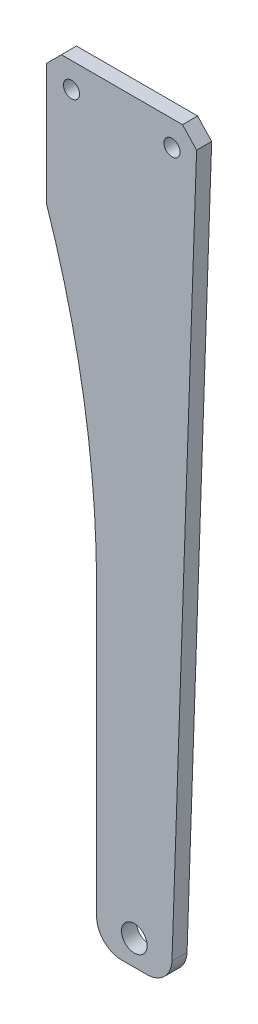
ISO-10303-21;
HEADER;
FILE_DESCRIPTION(('STEP AP214'),'2;1');
FILE_NAME('part.step','',(''),(''),'','','');
FILE_SCHEMA(('AUTOMOTIVE_DESIGN { 1 0 10303 214 1 1 1 1 }'));
ENDSEC;
DATA;
#1=APPLICATION_CONTEXT('core data for automotive mechanical design processes');
#2=APPLICATION_PROTOCOL_DEFINITION('international standard','automotive_design',2000,#1);
#3=PRODUCT_CONTEXT('',#1,'mechanical');
#4=PRODUCT('Part','Part','',(#3));
#5=PRODUCT_RELATED_PRODUCT_CATEGORY('part','',(#4));
#6=PRODUCT_DEFINITION_FORMATION('','',#4);
#7=PRODUCT_DEFINITION_CONTEXT('part definition',#1,'design');
#8=PRODUCT_DEFINITION('design','',#6,#7);
#9=PRODUCT_DEFINITION_SHAPE('','',#8);
#10=(LENGTH_UNIT() NAMED_UNIT(*) SI_UNIT(.MILLI.,.METRE.));
#11=(NAMED_UNIT(*) PLANE_ANGLE_UNIT() SI_UNIT($,.RADIAN.));
#12=(NAMED_UNIT(*) SI_UNIT($,.STERADIAN.) SOLID_ANGLE_UNIT());
#13=UNCERTAINTY_MEASURE_WITH_UNIT(LENGTH_MEASURE(1.E-05),#10,'distance_accuracy_value','');
#14=(GEOMETRIC_REPRESENTATION_CONTEXT(3) GLOBAL_UNCERTAINTY_ASSIGNED_CONTEXT((#13)) GLOBAL_UNIT_ASSIGNED_CONTEXT((#10,
#11,#12)) REPRESENTATION_CONTEXT('',''));
#15=CARTESIAN_POINT('',(0.,0.,0.));
#16=DIRECTION('',(0.,0.,1.));
#17=DIRECTION('',(1.,0.,0.));
#18=AXIS2_PLACEMENT_3D('',#15,#16,#17);
#19=CARTESIAN_POINT('',(0.,0.,3.));
#20=DIRECTION('',(0.,0.,1.));
#21=DIRECTION('',(1.,0.,0.));
#22=AXIS2_PLACEMENT_3D('',#19,#20,#21);
#23=PLANE('',#22);
#24=CARTESIAN_POINT('',(20.,0.,3.));
#25=DIRECTION('',(0.,0.,1.));
#26=DIRECTION('',(1.,0.,0.));
#27=AXIS2_PLACEMENT_3D('',#24,#25,#26);
#28=CIRCLE('',#27,1.6);
#29=CARTESIAN_POINT('',(21.6,0.,3.));
#30=VERTEX_POINT('',#29);
#31=EDGE_CURVE('E239',#30,#30,#28,.T.);
#32=ORIENTED_EDGE('',*,*,#31,.F.);
#33=EDGE_LOOP('',(#32));
#34=FACE_BOUND('',#33,.T.);
#35=CARTESIAN_POINT('',(0.,0.,3.));
#36=DIRECTION('',(0.,0.,1.));
#37=DIRECTION('',(1.,0.,0.));
#38=AXIS2_PLACEMENT_3D('',#35,#36,#37);
#39=CIRCLE('',#38,1.6);
#40=CARTESIAN_POINT('',(1.6,0.,3.));
#41=VERTEX_POINT('',#40);
#42=EDGE_CURVE('E246',#41,#41,#39,.T.);
#43=ORIENTED_EDGE('',*,*,#42,.F.);
#44=EDGE_LOOP('',(#43));
#45=FACE_BOUND('',#44,.T.);
#46=CARTESIAN_POINT('',(12.5,-140.,3.));
#47=DIRECTION('',(0.,0.,1.));
#48=DIRECTION('',(1.,0.,0.));
#49=AXIS2_PLACEMENT_3D('',#46,#47,#48);
#50=CIRCLE('',#49,2.54999999999999);
#51=CARTESIAN_POINT('',(15.05,-140.,3.));
#52=VERTEX_POINT('',#51);
#53=EDGE_CURVE('E219',#52,#52,#50,.T.);
#54=ORIENTED_EDGE('',*,*,#53,.F.);
#55=EDGE_LOOP('',(#54));
#56=FACE_BOUND('',#55,.T.);
#57=DIRECTION('',(-0.0344418416394506,-0.999406703772035,0.));
#58=VECTOR('',#57,1.);
#59=CARTESIAN_POINT('',(24.7982369514885,-0.854603983340457,3.));
#60=LINE('',#59,#58);
#61=CARTESIAN_POINT('',(24.8966744750817,2.00177988868389,3.));
#62=VERTEX_POINT('',#61);
#63=CARTESIAN_POINT('',(19.9970335188602,-140.172209208197,3.));
#64=VERTEX_POINT('',#63);
#65=EDGE_CURVE('E179',#62,#64,#60,.T.);
#66=ORIENTED_EDGE('',*,*,#65,.F.);
#67=DIRECTION('',(0.682333197620691,-0.731041317180311,0.));
#68=VECTOR('',#67,1.);
#69=CARTESIAN_POINT('',(14.3038311652233,13.3507896582896,3.));
#70=LINE('',#69,#68);
#71=CARTESIAN_POINT('',(22.0982209983127,5.,3.));
#72=VERTEX_POINT('',#71);
#73=EDGE_CURVE('E49',#62,#72,#70,.F.);
#74=ORIENTED_EDGE('',*,*,#73,.T.);
#75=DIRECTION('',(-1.,0.,0.));
#76=VECTOR('',#75,1.);
#77=CARTESIAN_POINT('',(-5.,5.,3.));
#78=LINE('',#77,#76);
#79=CARTESIAN_POINT('',(-2.,5.,3.));
#80=VERTEX_POINT('',#79);
#81=EDGE_CURVE('E148',#72,#80,#78,.T.);
#82=ORIENTED_EDGE('',*,*,#81,.T.);
#83=DIRECTION('',(0.707106781186551,0.707106781186544,0.));
#84=VECTOR('',#83,1.);
#85=CARTESIAN_POINT('',(-3.49999999999999,3.50000000000002,3.));
#86=LINE('',#85,#84);
#87=CARTESIAN_POINT('',(-5.,2.00000000000003,3.));
#88=VERTEX_POINT('',#87);
#89=EDGE_CURVE('E56',#80,#88,#86,.F.);
#90=ORIENTED_EDGE('',*,*,#89,.T.);
#91=DIRECTION('',(0.,-1.,0.));
#92=VECTOR('',#91,1.);
#93=CARTESIAN_POINT('',(-5.,5.,3.));
#94=LINE('',#93,#92);
#95=CARTESIAN_POINT('',(-5.,-22.058761090833,3.));
#96=VERTEX_POINT('',#95);
#97=EDGE_CURVE('E152',#88,#96,#94,.T.);
#98=ORIENTED_EDGE('',*,*,#97,.T.);
#99=CARTESIAN_POINT('',(-186.334443723791,-83.1053734004102,3.));
#100=DIRECTION('',(0.,0.,1.));
#101=DIRECTION('',(1.,0.,0.));
#102=AXIS2_PLACEMENT_3D('',#99,#100,#101);
#103=CIRCLE('',#102,191.334443723791);
#104=CARTESIAN_POINT('',(5.,-83.1053734004102,3.));
#105=VERTEX_POINT('',#104);
#106=EDGE_CURVE('E210',#105,#96,#103,.T.);
#107=ORIENTED_EDGE('',*,*,#106,.F.);
#108=DIRECTION('',(0.,1.,0.));
#109=VECTOR('',#108,1.);
#110=CARTESIAN_POINT('',(5.,0.,3.));
#111=LINE('',#110,#109);
#112=CARTESIAN_POINT('',(5.,-140.,3.));
#113=VERTEX_POINT('',#112);
#114=EDGE_CURVE('E199',#113,#105,#111,.T.);
#115=ORIENTED_EDGE('',*,*,#114,.F.);
#116=CARTESIAN_POINT('',(10.,-140.,3.));
#117=DIRECTION('',(0.,0.,1.));
#118=DIRECTION('',(1.,0.,0.));
#119=AXIS2_PLACEMENT_3D('',#116,#117,#118);
#120=CIRCLE('',#119,5.);
#121=CARTESIAN_POINT('',(10.,-145.,3.));
#122=VERTEX_POINT('',#121);
#123=EDGE_CURVE('E203',#113,#122,#120,.T.);
#124=ORIENTED_EDGE('',*,*,#123,.T.);
#125=DIRECTION('',(1.,0.,0.));
#126=VECTOR('',#125,1.);
#127=CARTESIAN_POINT('',(-4.99999999999998,-145.,3.));
#128=LINE('',#127,#126);
#129=CARTESIAN_POINT('',(15.,-145.,3.));
#130=VERTEX_POINT('',#129);
#131=EDGE_CURVE('E163',#122,#130,#128,.T.);
#132=ORIENTED_EDGE('',*,*,#131,.T.);
#133=CARTESIAN_POINT('',(15.,-140.,3.));
#134=DIRECTION('',(0.,0.,1.));
#135=DIRECTION('',(1.,0.,0.));
#136=AXIS2_PLACEMENT_3D('',#133,#134,#135);
#137=CIRCLE('',#136,5.);
#138=EDGE_CURVE('E126',#130,#64,#137,.T.);
#139=ORIENTED_EDGE('',*,*,#138,.T.);
#140=EDGE_LOOP('',(#66,#74,#82,#90,#98,#107,#115,#124,#132,#139));
#141=FACE_BOUND('',#140,.T.);
#142=ADVANCED_FACE('F40',(#34,#45,#56,#141),#23,.T.);
#143=CARTESIAN_POINT('',(0.,0.,0.));
#144=DIRECTION('',(0.,0.,1.));
#145=DIRECTION('',(1.,0.,0.));
#146=AXIS2_PLACEMENT_3D('',#143,#144,#145);
#147=PLANE('',#146);
#148=CARTESIAN_POINT('',(20.,0.,0.));
#149=DIRECTION('',(0.,0.,1.));
#150=DIRECTION('',(1.,0.,0.));
#151=AXIS2_PLACEMENT_3D('',#148,#149,#150);
#152=CIRCLE('',#151,1.6);
#153=CARTESIAN_POINT('',(21.6,0.,0.));
#154=VERTEX_POINT('',#153);
#155=EDGE_CURVE('E238',#154,#154,#152,.T.);
#156=ORIENTED_EDGE('',*,*,#155,.T.);
#157=EDGE_LOOP('',(#156));
#158=FACE_BOUND('',#157,.T.);
#159=CARTESIAN_POINT('',(0.,0.,0.));
#160=DIRECTION('',(0.,0.,1.));
#161=DIRECTION('',(1.,0.,0.));
#162=AXIS2_PLACEMENT_3D('',#159,#160,#161);
#163=CIRCLE('',#162,1.6);
#164=CARTESIAN_POINT('',(1.6,0.,0.));
#165=VERTEX_POINT('',#164);
#166=EDGE_CURVE('E242',#165,#165,#163,.T.);
#167=ORIENTED_EDGE('',*,*,#166,.T.);
#168=EDGE_LOOP('',(#167));
#169=FACE_BOUND('',#168,.T.);
#170=CARTESIAN_POINT('',(12.5,-140.,0.));
#171=DIRECTION('',(0.,0.,1.));
#172=DIRECTION('',(1.,0.,0.));
#173=AXIS2_PLACEMENT_3D('',#170,#171,#172);
#174=CIRCLE('',#173,2.54999999999999);
#175=CARTESIAN_POINT('',(15.05,-140.,0.));
#176=VERTEX_POINT('',#175);
#177=EDGE_CURVE('E234',#176,#176,#174,.F.);
#178=ORIENTED_EDGE('',*,*,#177,.F.);
#179=EDGE_LOOP('',(#178));
#180=FACE_BOUND('',#179,.T.);
#181=DIRECTION('',(-1.,0.,0.));
#182=VECTOR('',#181,1.);
#183=CARTESIAN_POINT('',(-5.,5.,0.));
#184=LINE('',#183,#182);
#185=CARTESIAN_POINT('',(22.0982209983127,5.,0.));
#186=VERTEX_POINT('',#185);
#187=CARTESIAN_POINT('',(-2.,5.,0.));
#188=VERTEX_POINT('',#187);
#189=EDGE_CURVE('E155',#186,#188,#184,.T.);
#190=ORIENTED_EDGE('',*,*,#189,.F.);
#191=DIRECTION('',(-0.682333197620691,0.731041317180311,0.));
#192=VECTOR('',#191,1.);
#193=CARTESIAN_POINT('',(22.0982209983127,5.,0.));
#194=LINE('',#193,#192);
#195=CARTESIAN_POINT('',(24.8966744750817,2.0017798886839,0.));
#196=VERTEX_POINT('',#195);
#197=EDGE_CURVE('E170',#186,#196,#194,.F.);
#198=ORIENTED_EDGE('',*,*,#197,.T.);
#199=DIRECTION('',(-0.0344418416394506,-0.999406703772035,0.));
#200=VECTOR('',#199,1.);
#201=CARTESIAN_POINT('',(24.7982369514885,-0.854603983340457,0.));
#202=LINE('',#201,#200);
#203=CARTESIAN_POINT('',(19.9970335188602,-140.172209208197,0.));
#204=VERTEX_POINT('',#203);
#205=EDGE_CURVE('E140',#196,#204,#202,.T.);
#206=ORIENTED_EDGE('',*,*,#205,.T.);
#207=CARTESIAN_POINT('',(15.,-140.,0.));
#208=DIRECTION('',(0.,0.,1.));
#209=DIRECTION('',(1.,0.,0.));
#210=AXIS2_PLACEMENT_3D('',#207,#208,#209);
#211=CIRCLE('',#210,5.);
#212=CARTESIAN_POINT('',(15.,-145.,0.));
#213=VERTEX_POINT('',#212);
#214=EDGE_CURVE('E124',#213,#204,#211,.T.);
#215=ORIENTED_EDGE('',*,*,#214,.F.);
#216=DIRECTION('',(1.,0.,0.));
#217=VECTOR('',#216,1.);
#218=CARTESIAN_POINT('',(-4.99999999999998,-145.,0.));
#219=LINE('',#218,#217);
#220=CARTESIAN_POINT('',(10.,-145.,0.));
#221=VERTEX_POINT('',#220);
#222=EDGE_CURVE('E138',#221,#213,#219,.T.);
#223=ORIENTED_EDGE('',*,*,#222,.F.);
#224=CARTESIAN_POINT('',(10.,-140.,0.));
#225=DIRECTION('',(0.,0.,1.));
#226=DIRECTION('',(1.,0.,0.));
#227=AXIS2_PLACEMENT_3D('',#224,#225,#226);
#228=CIRCLE('',#227,5.);
#229=CARTESIAN_POINT('',(5.,-140.,0.));
#230=VERTEX_POINT('',#229);
#231=EDGE_CURVE('E143',#230,#221,#228,.T.);
#232=ORIENTED_EDGE('',*,*,#231,.F.);
#233=DIRECTION('',(0.,1.,0.));
#234=VECTOR('',#233,1.);
#235=CARTESIAN_POINT('',(5.,0.,0.));
#236=LINE('',#235,#234);
#237=CARTESIAN_POINT('',(5.,-83.1053734004102,0.));
#238=VERTEX_POINT('',#237);
#239=EDGE_CURVE('E214',#230,#238,#236,.T.);
#240=ORIENTED_EDGE('',*,*,#239,.T.);
#241=CARTESIAN_POINT('',(-186.334443723791,-83.1053734004102,0.));
#242=DIRECTION('',(0.,0.,1.));
#243=DIRECTION('',(1.,0.,0.));
#244=AXIS2_PLACEMENT_3D('',#241,#242,#243);
#245=CIRCLE('',#244,191.334443723791);
#246=CARTESIAN_POINT('',(-5.,-22.058761090833,0.));
#247=VERTEX_POINT('',#246);
#248=EDGE_CURVE('E189',#238,#247,#245,.T.);
#249=ORIENTED_EDGE('',*,*,#248,.T.);
#250=DIRECTION('',(0.,-1.,0.));
#251=VECTOR('',#250,1.);
#252=CARTESIAN_POINT('',(-5.,5.,0.));
#253=LINE('',#252,#251);
#254=CARTESIAN_POINT('',(-5.,2.00000000000003,0.));
#255=VERTEX_POINT('',#254);
#256=EDGE_CURVE('E149',#255,#247,#253,.T.);
#257=ORIENTED_EDGE('',*,*,#256,.F.);
#258=DIRECTION('',(-0.707106781186551,-0.707106781186544,0.));
#259=VECTOR('',#258,1.);
#260=CARTESIAN_POINT('',(-5.,2.00000000000003,0.));
#261=LINE('',#260,#259);
#262=EDGE_CURVE('E167',#255,#188,#261,.F.);
#263=ORIENTED_EDGE('',*,*,#262,.T.);
#264=EDGE_LOOP('',(#190,#198,#206,#215,#223,#232,#240,#249,#257,#263));
#265=FACE_BOUND('',#264,.T.);
#266=ADVANCED_FACE('F137',(#158,#169,#180,#265),#147,.F.);
#267=CARTESIAN_POINT('',(-5.,5.,3.));
#268=DIRECTION('',(1.,0.,0.));
#269=DIRECTION('',(0.,1.,0.));
#270=AXIS2_PLACEMENT_3D('',#267,#268,#269);
#271=PLANE('',#270);
#272=ORIENTED_EDGE('',*,*,#97,.F.);
#273=DIRECTION('',(0.,0.,-1.));
#274=VECTOR('',#273,1.);
#275=CARTESIAN_POINT('',(-5.,2.00000000000003,3.));
#276=LINE('',#275,#274);
#277=EDGE_CURVE('E11',#88,#255,#276,.T.);
#278=ORIENTED_EDGE('',*,*,#277,.T.);
#279=ORIENTED_EDGE('',*,*,#256,.T.);
#280=DIRECTION('',(0.,0.,1.));
#281=VECTOR('',#280,1.);
#282=CARTESIAN_POINT('',(-5.,-22.058761090833,0.));
#283=LINE('',#282,#281);
#284=EDGE_CURVE('E220',#247,#96,#283,.T.);
#285=ORIENTED_EDGE('',*,*,#284,.T.);
#286=EDGE_LOOP('',(#272,#278,#279,#285));
#287=FACE_BOUND('',#286,.T.);
#288=ADVANCED_FACE('F261',(#287),#271,.F.);
#289=CARTESIAN_POINT('',(-4.99999999999998,-145.,3.));
#290=DIRECTION('',(0.,1.,0.));
#291=DIRECTION('',(0.,0.,1.));
#292=AXIS2_PLACEMENT_3D('',#289,#290,#291);
#293=PLANE('',#292);
#294=ORIENTED_EDGE('',*,*,#222,.T.);
#295=DIRECTION('',(0.,0.,1.));
#296=VECTOR('',#295,1.);
#297=CARTESIAN_POINT('',(15.,-145.,0.));
#298=LINE('',#297,#296);
#299=EDGE_CURVE('E120',#213,#130,#298,.T.);
#300=ORIENTED_EDGE('',*,*,#299,.T.);
#301=ORIENTED_EDGE('',*,*,#131,.F.);
#302=DIRECTION('',(0.,0.,1.));
#303=VECTOR('',#302,1.);
#304=CARTESIAN_POINT('',(10.,-145.,0.));
#305=LINE('',#304,#303);
#306=EDGE_CURVE('E132',#221,#122,#305,.T.);
#307=ORIENTED_EDGE('',*,*,#306,.F.);
#308=EDGE_LOOP('',(#294,#300,#301,#307));
#309=FACE_BOUND('',#308,.T.);
#310=ADVANCED_FACE('F145',(#309),#293,.F.);
#311=CARTESIAN_POINT('',(-5.,5.,3.));
#312=DIRECTION('',(0.,-1.,0.));
#313=DIRECTION('',(0.,0.,-1.));
#314=AXIS2_PLACEMENT_3D('',#311,#312,#313);
#315=PLANE('',#314);
#316=ORIENTED_EDGE('',*,*,#81,.F.);
#317=DIRECTION('',(0.,0.,-1.));
#318=VECTOR('',#317,1.);
#319=CARTESIAN_POINT('',(22.0982209983127,5.,3.));
#320=LINE('',#319,#318);
#321=EDGE_CURVE('E162',#72,#186,#320,.T.);
#322=ORIENTED_EDGE('',*,*,#321,.T.);
#323=ORIENTED_EDGE('',*,*,#189,.T.);
#324=DIRECTION('',(0.,0.,1.));
#325=VECTOR('',#324,1.);
#326=CARTESIAN_POINT('',(-2.,5.,3.));
#327=LINE('',#326,#325);
#328=EDGE_CURVE('E159',#188,#80,#327,.T.);
#329=ORIENTED_EDGE('',*,*,#328,.T.);
#330=EDGE_LOOP('',(#316,#322,#323,#329));
#331=FACE_BOUND('',#330,.T.);
#332=ADVANCED_FACE('F183',(#331),#315,.F.);
#333=CARTESIAN_POINT('',(0.,0.,3.));
#334=DIRECTION('',(0.,0.,-1.));
#335=DIRECTION('',(-1.,0.,0.));
#336=AXIS2_PLACEMENT_3D('',#333,#334,#335);
#337=CYLINDRICAL_SURFACE('',#336,1.6);
#338=ORIENTED_EDGE('',*,*,#42,.T.);
#339=EDGE_LOOP('',(#338));
#340=FACE_BOUND('',#339,.T.);
#341=ORIENTED_EDGE('',*,*,#166,.F.);
#342=EDGE_LOOP('',(#341));
#343=FACE_BOUND('',#342,.T.);
#344=ADVANCED_FACE('F301',(#340,#343),#337,.F.);
#345=CARTESIAN_POINT('',(20.,0.,3.));
#346=DIRECTION('',(0.,0.,-1.));
#347=DIRECTION('',(-1.,0.,0.));
#348=AXIS2_PLACEMENT_3D('',#345,#346,#347);
#349=CYLINDRICAL_SURFACE('',#348,1.6);
#350=ORIENTED_EDGE('',*,*,#31,.T.);
#351=EDGE_LOOP('',(#350));
#352=FACE_BOUND('',#351,.T.);
#353=ORIENTED_EDGE('',*,*,#155,.F.);
#354=EDGE_LOOP('',(#353));
#355=FACE_BOUND('',#354,.T.);
#356=ADVANCED_FACE('F285',(#352,#355),#349,.F.);
#357=CARTESIAN_POINT('',(12.5,-140.,-0.00100000000000013));
#358=DIRECTION('',(0.,0.,1.));
#359=DIRECTION('',(1.,0.,0.));
#360=AXIS2_PLACEMENT_3D('',#357,#358,#359);
#361=CYLINDRICAL_SURFACE('',#360,2.54999999999999);
#362=CARTESIAN_POINT('',(15.05,-140.,3.));
#363=CARTESIAN_POINT('',(15.05,-140.,2.96875));
#364=CARTESIAN_POINT('',(15.05,-140.,2.9375));
#365=CARTESIAN_POINT('',(15.05,-140.,2.875));
#366=CARTESIAN_POINT('',(15.05,-140.,2.84375));
#367=CARTESIAN_POINT('',(15.05,-140.,2.78125));
#368=CARTESIAN_POINT('',(15.05,-140.,2.75));
#369=CARTESIAN_POINT('',(15.05,-140.,2.6875));
#370=CARTESIAN_POINT('',(15.05,-140.,2.65625));
#371=CARTESIAN_POINT('',(15.05,-140.,2.59375));
#372=CARTESIAN_POINT('',(15.05,-140.,2.5625));
#373=CARTESIAN_POINT('',(15.05,-140.,2.5));
#374=CARTESIAN_POINT('',(15.05,-140.,2.46875));
#375=CARTESIAN_POINT('',(15.05,-140.,2.40625));
#376=CARTESIAN_POINT('',(15.05,-140.,2.375));
#377=CARTESIAN_POINT('',(15.05,-140.,2.3125));
#378=CARTESIAN_POINT('',(15.05,-140.,2.28125));
#379=CARTESIAN_POINT('',(15.05,-140.,2.21875));
#380=CARTESIAN_POINT('',(15.05,-140.,2.1875));
#381=CARTESIAN_POINT('',(15.05,-140.,2.125));
#382=CARTESIAN_POINT('',(15.05,-140.,2.09375));
#383=CARTESIAN_POINT('',(15.05,-140.,2.03125));
#384=CARTESIAN_POINT('',(15.05,-140.,2.));
#385=CARTESIAN_POINT('',(15.05,-140.,1.9375));
#386=CARTESIAN_POINT('',(15.05,-140.,1.90625));
#387=CARTESIAN_POINT('',(15.05,-140.,1.84375));
#388=CARTESIAN_POINT('',(15.05,-140.,1.8125));
#389=CARTESIAN_POINT('',(15.05,-140.,1.75));
#390=CARTESIAN_POINT('',(15.05,-140.,1.71875));
#391=CARTESIAN_POINT('',(15.05,-140.,1.65625));
#392=CARTESIAN_POINT('',(15.05,-140.,1.625));
#393=CARTESIAN_POINT('',(15.05,-140.,1.5625));
#394=CARTESIAN_POINT('',(15.05,-140.,1.53125));
#395=CARTESIAN_POINT('',(15.05,-140.,1.46875));
#396=CARTESIAN_POINT('',(15.05,-140.,1.4375));
#397=CARTESIAN_POINT('',(15.05,-140.,1.375));
#398=CARTESIAN_POINT('',(15.05,-140.,1.34375));
#399=CARTESIAN_POINT('',(15.05,-140.,1.28125));
#400=CARTESIAN_POINT('',(15.05,-140.,1.25));
#401=CARTESIAN_POINT('',(15.05,-140.,1.1875));
#402=CARTESIAN_POINT('',(15.05,-140.,1.15625));
#403=CARTESIAN_POINT('',(15.05,-140.,1.09375));
#404=CARTESIAN_POINT('',(15.05,-140.,1.0625));
#405=CARTESIAN_POINT('',(15.05,-140.,1.));
#406=CARTESIAN_POINT('',(15.05,-140.,0.96875));
#407=CARTESIAN_POINT('',(15.05,-140.,0.90625));
#408=CARTESIAN_POINT('',(15.05,-140.,0.875));
#409=CARTESIAN_POINT('',(15.05,-140.,0.8125));
#410=CARTESIAN_POINT('',(15.05,-140.,0.78125));
#411=CARTESIAN_POINT('',(15.05,-140.,0.71875));
#412=CARTESIAN_POINT('',(15.05,-140.,0.6875));
#413=CARTESIAN_POINT('',(15.05,-140.,0.625));
#414=CARTESIAN_POINT('',(15.05,-140.,0.59375));
#415=CARTESIAN_POINT('',(15.05,-140.,0.53125));
#416=CARTESIAN_POINT('',(15.05,-140.,0.5));
#417=CARTESIAN_POINT('',(15.05,-140.,0.4375));
#418=CARTESIAN_POINT('',(15.05,-140.,0.40625));
#419=CARTESIAN_POINT('',(15.05,-140.,0.34375));
#420=CARTESIAN_POINT('',(15.05,-140.,0.3125));
#421=CARTESIAN_POINT('',(15.05,-140.,0.25));
#422=CARTESIAN_POINT('',(15.05,-140.,0.21875));
#423=CARTESIAN_POINT('',(15.05,-140.,0.15625));
#424=CARTESIAN_POINT('',(15.05,-140.,0.125));
#425=CARTESIAN_POINT('',(15.05,-140.,0.0625000000000001));
#426=CARTESIAN_POINT('',(15.05,-140.,0.0312500000000001));
#427=CARTESIAN_POINT('',(15.05,-140.,0.));
#428=B_SPLINE_CURVE_WITH_KNOTS('',3,(#362,#363,#364,#365,#366,#367,#368,#369,#370,#371,#372,
#373,#374,#375,#376,#377,#378,#379,#380,#381,#382,#383,#384,#385,#386,#387,#388,#389,#390,#391,
#392,#393,#394,#395,#396,#397,#398,#399,#400,#401,#402,#403,#404,#405,#406,#407,#408,#409,#410,
#411,#412,#413,#414,#415,#416,#417,#418,#419,#420,#421,#422,#423,#424,#425,#426,#427),
.UNSPECIFIED.,.F.,.F.,(4,2,2,2,2,2,2,2,2,2,2,2,2,2,2,2,2,2,2,2,2,2,2,2,2,2,2,2,2,2,2,2,4),(0.,
0.0937500000000001,0.1875,0.28125,0.375,0.46875,0.5625,0.65625,0.75,0.84375,0.9375,1.03125,
1.125,1.21875,1.3125,1.40625,1.5,1.59375,1.6875,1.78125,1.875,1.96875,2.0625,2.15625,2.25,
2.34375,2.4375,2.53125,2.625,2.71875,2.8125,2.90625,3.),.UNSPECIFIED.);
#429=EDGE_CURVE('BSEAM278',#52,#176,#428,.T.);
#430=ORIENTED_EDGE('',*,*,#53,.T.);
#431=ORIENTED_EDGE('',*,*,#177,.T.);
#432=ORIENTED_EDGE('',*,*,#429,.T.);
#433=ORIENTED_EDGE('',*,*,#429,.F.);
#434=EDGE_LOOP('',(#430,#432,#431,#433));
#435=FACE_BOUND('',#434,.T.);
#436=ADVANCED_FACE('F278',(#435),#361,.F.);
#437=CARTESIAN_POINT('',(10.,-140.,0.));
#438=DIRECTION('',(0.,0.,1.));
#439=DIRECTION('',(1.,0.,0.));
#440=AXIS2_PLACEMENT_3D('',#437,#438,#439);
#441=CYLINDRICAL_SURFACE('',#440,5.);
#442=ORIENTED_EDGE('',*,*,#123,.F.);
#443=DIRECTION('',(0.,0.,1.));
#444=VECTOR('',#443,1.);
#445=CARTESIAN_POINT('',(5.,-140.,0.));
#446=LINE('',#445,#444);
#447=EDGE_CURVE('E195',#230,#113,#446,.T.);
#448=ORIENTED_EDGE('',*,*,#447,.F.);
#449=ORIENTED_EDGE('',*,*,#231,.T.);
#450=ORIENTED_EDGE('',*,*,#306,.T.);
#451=EDGE_LOOP('',(#442,#448,#449,#450));
#452=FACE_BOUND('',#451,.T.);
#453=ADVANCED_FACE('F273',(#452),#441,.T.);
#454=CARTESIAN_POINT('',(-186.334443723791,-83.1053734004102,0.));
#455=DIRECTION('',(0.,0.,1.));
#456=DIRECTION('',(1.,0.,0.));
#457=AXIS2_PLACEMENT_3D('',#454,#455,#456);
#458=CYLINDRICAL_SURFACE('',#457,191.334443723791);
#459=ORIENTED_EDGE('',*,*,#106,.T.);
#460=ORIENTED_EDGE('',*,*,#284,.F.);
#461=ORIENTED_EDGE('',*,*,#248,.F.);
#462=DIRECTION('',(0.,0.,1.));
#463=VECTOR('',#462,1.);
#464=CARTESIAN_POINT('',(5.,-83.1053734004102,0.));
#465=LINE('',#464,#463);
#466=EDGE_CURVE('E215',#238,#105,#465,.T.);
#467=ORIENTED_EDGE('',*,*,#466,.T.);
#468=EDGE_LOOP('',(#459,#460,#461,#467));
#469=FACE_BOUND('',#468,.T.);
#470=ADVANCED_FACE('F267',(#469),#458,.F.);
#471=CARTESIAN_POINT('',(5.,0.,0.));
#472=DIRECTION('',(1.,0.,0.));
#473=DIRECTION('',(0.,0.,-1.));
#474=AXIS2_PLACEMENT_3D('',#471,#472,#473);
#475=PLANE('',#474);
#476=ORIENTED_EDGE('',*,*,#114,.T.);
#477=ORIENTED_EDGE('',*,*,#466,.F.);
#478=ORIENTED_EDGE('',*,*,#239,.F.);
#479=ORIENTED_EDGE('',*,*,#447,.T.);
#480=EDGE_LOOP('',(#476,#477,#478,#479));
#481=FACE_BOUND('',#480,.T.);
#482=ADVANCED_FACE('F271',(#481),#475,.F.);
#483=CARTESIAN_POINT('',(24.7982369514885,-0.854603983340457,0.));
#484=DIRECTION('',(-0.999406703772034,0.0344418416394506,0.));
#485=DIRECTION('',(-0.0344418416394506,-0.999406703772035,0.));
#486=AXIS2_PLACEMENT_3D('',#483,#484,#485);
#487=PLANE('',#486);
#488=ORIENTED_EDGE('',*,*,#205,.F.);
#489=DIRECTION('',(0.,0.,1.));
#490=VECTOR('',#489,1.);
#491=CARTESIAN_POINT('',(24.8966744750817,2.0017798886839,0.));
#492=LINE('',#491,#490);
#493=EDGE_CURVE('E64',#196,#62,#492,.T.);
#494=ORIENTED_EDGE('',*,*,#493,.T.);
#495=ORIENTED_EDGE('',*,*,#65,.T.);
#496=DIRECTION('',(0.,0.,1.));
#497=VECTOR('',#496,1.);
#498=CARTESIAN_POINT('',(19.9970335188602,-140.172209208197,0.));
#499=LINE('',#498,#497);
#500=EDGE_CURVE('E131',#204,#64,#499,.T.);
#501=ORIENTED_EDGE('',*,*,#500,.F.);
#502=EDGE_LOOP('',(#488,#494,#495,#501));
#503=FACE_BOUND('',#502,.T.);
#504=ADVANCED_FACE('F187',(#503),#487,.F.);
#505=CARTESIAN_POINT('',(15.,-140.,0.));
#506=DIRECTION('',(0.,0.,1.));
#507=DIRECTION('',(1.,0.,0.));
#508=AXIS2_PLACEMENT_3D('',#505,#506,#507);
#509=CYLINDRICAL_SURFACE('',#508,5.);
#510=ORIENTED_EDGE('',*,*,#138,.F.);
#511=ORIENTED_EDGE('',*,*,#299,.F.);
#512=ORIENTED_EDGE('',*,*,#214,.T.);
#513=ORIENTED_EDGE('',*,*,#500,.T.);
#514=EDGE_LOOP('',(#510,#511,#512,#513));
#515=FACE_BOUND('',#514,.T.);
#516=ADVANCED_FACE('F122',(#515),#509,.T.);
#517=CARTESIAN_POINT('',(22.0982209983127,5.,3.));
#518=DIRECTION('',(-0.731041317180311,-0.68233319762069,0.));
#519=DIRECTION('',(0.,0.,-1.));
#520=AXIS2_PLACEMENT_3D('',#517,#518,#519);
#521=PLANE('',#520);
#522=ORIENTED_EDGE('',*,*,#73,.F.);
#523=ORIENTED_EDGE('',*,*,#493,.F.);
#524=ORIENTED_EDGE('',*,*,#197,.F.);
#525=ORIENTED_EDGE('',*,*,#321,.F.);
#526=EDGE_LOOP('',(#522,#523,#524,#525));
#527=FACE_BOUND('',#526,.T.);
#528=ADVANCED_FACE('F186',(#527),#521,.F.);
#529=CARTESIAN_POINT('',(-5.,2.00000000000003,3.));
#530=DIRECTION('',(0.707106781186544,-0.707106781186551,0.));
#531=DIRECTION('',(0.,0.,-1.));
#532=AXIS2_PLACEMENT_3D('',#529,#530,#531);
#533=PLANE('',#532);
#534=ORIENTED_EDGE('',*,*,#89,.F.);
#535=ORIENTED_EDGE('',*,*,#328,.F.);
#536=ORIENTED_EDGE('',*,*,#262,.F.);
#537=ORIENTED_EDGE('',*,*,#277,.F.);
#538=EDGE_LOOP('',(#534,#535,#536,#537));
#539=FACE_BOUND('',#538,.T.);
#540=ADVANCED_FACE('F42',(#539),#533,.F.);
#541=CLOSED_SHELL('',(#142,#266,#288,#310,#332,#344,#356,#436,#453,#470,#482,#504,#516,#528,#540));
#542=MANIFOLD_SOLID_BREP('B2',#541);
#543=ADVANCED_BREP_SHAPE_REPRESENTATION('',(#18,#542),#14);
#544=SHAPE_DEFINITION_REPRESENTATION(#9,#543);
ENDSEC;
END-ISO-10303-21;
